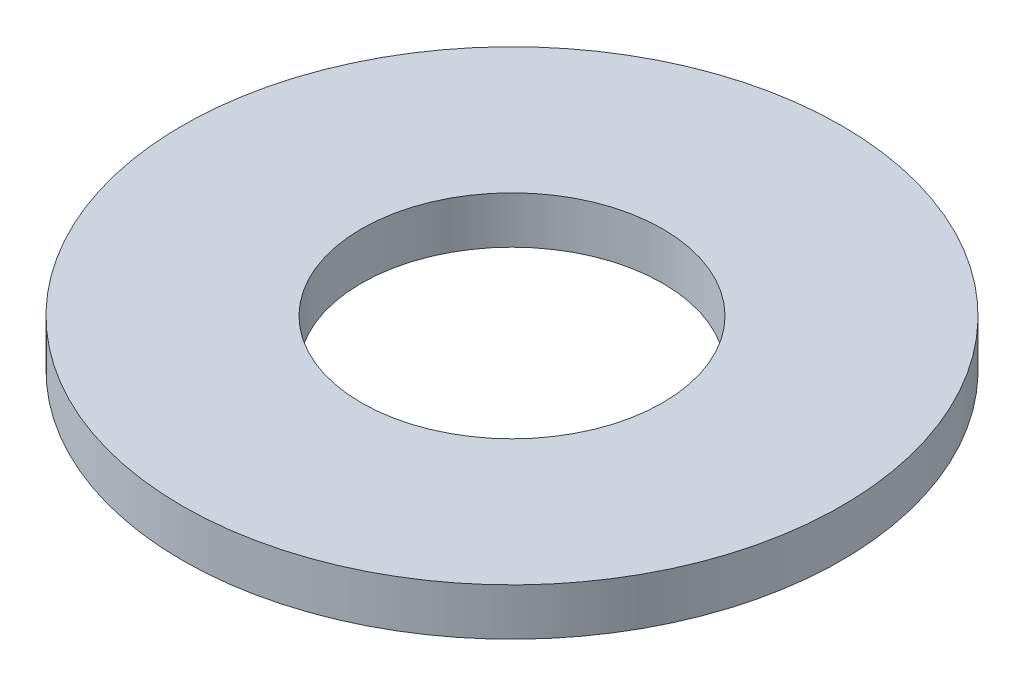
ISO-10303-21;
HEADER;
FILE_DESCRIPTION(('STEP AP214'),'2;1');
FILE_NAME('part.step','',(''),(''),'','','');
FILE_SCHEMA(('AUTOMOTIVE_DESIGN { 1 0 10303 214 1 1 1 1 }'));
ENDSEC;
DATA;
#1=APPLICATION_CONTEXT('core data for automotive mechanical design processes');
#2=APPLICATION_PROTOCOL_DEFINITION('international standard','automotive_design',2000,#1);
#3=PRODUCT_CONTEXT('',#1,'mechanical');
#4=PRODUCT('Part','Part','',(#3));
#5=PRODUCT_RELATED_PRODUCT_CATEGORY('part','',(#4));
#6=PRODUCT_DEFINITION_FORMATION('','',#4);
#7=PRODUCT_DEFINITION_CONTEXT('part definition',#1,'design');
#8=PRODUCT_DEFINITION('design','',#6,#7);
#9=PRODUCT_DEFINITION_SHAPE('','',#8);
#10=(LENGTH_UNIT() NAMED_UNIT(*) SI_UNIT(.MILLI.,.METRE.));
#11=(NAMED_UNIT(*) PLANE_ANGLE_UNIT() SI_UNIT($,.RADIAN.));
#12=(NAMED_UNIT(*) SI_UNIT($,.STERADIAN.) SOLID_ANGLE_UNIT());
#13=UNCERTAINTY_MEASURE_WITH_UNIT(LENGTH_MEASURE(1.E-05),#10,'distance_accuracy_value','');
#14=(GEOMETRIC_REPRESENTATION_CONTEXT(3) GLOBAL_UNCERTAINTY_ASSIGNED_CONTEXT((#13)) GLOBAL_UNIT_ASSIGNED_CONTEXT((#10,
#11,#12)) REPRESENTATION_CONTEXT('',''));
#15=CARTESIAN_POINT('',(0.,0.,0.));
#16=DIRECTION('',(0.,0.,1.));
#17=DIRECTION('',(1.,0.,0.));
#18=AXIS2_PLACEMENT_3D('',#15,#16,#17);
#19=CARTESIAN_POINT('',(0.,0.5,0.));
#20=DIRECTION('',(0.,1.,0.));
#21=DIRECTION('',(0.,0.,1.));
#22=AXIS2_PLACEMENT_3D('',#19,#20,#21);
#23=PLANE('',#22);
#24=CARTESIAN_POINT('',(0.,0.5,0.));
#25=DIRECTION('',(0.,1.,0.));
#26=DIRECTION('',(0.,0.,1.));
#27=AXIS2_PLACEMENT_3D('',#24,#25,#26);
#28=CIRCLE('',#27,3.5);
#29=CARTESIAN_POINT('',(0.,0.5,3.5));
#30=VERTEX_POINT('',#29);
#31=EDGE_CURVE('E10',#30,#30,#28,.T.);
#32=ORIENTED_EDGE('',*,*,#31,.T.);
#33=EDGE_LOOP('',(#32));
#34=FACE_BOUND('',#33,.T.);
#35=CARTESIAN_POINT('',(0.,0.5,0.));
#36=DIRECTION('',(0.,1.,0.));
#37=DIRECTION('',(0.,0.,1.));
#38=AXIS2_PLACEMENT_3D('',#35,#36,#37);
#39=CIRCLE('',#38,1.6);
#40=CARTESIAN_POINT('',(0.,0.5,1.6));
#41=VERTEX_POINT('',#40);
#42=EDGE_CURVE('E39',#41,#41,#39,.T.);
#43=ORIENTED_EDGE('',*,*,#42,.F.);
#44=EDGE_LOOP('',(#43));
#45=FACE_BOUND('',#44,.T.);
#46=ADVANCED_FACE('F28',(#34,#45),#23,.T.);
#47=CARTESIAN_POINT('',(0.,0.,0.));
#48=DIRECTION('',(0.,1.,0.));
#49=DIRECTION('',(0.,0.,1.));
#50=AXIS2_PLACEMENT_3D('',#47,#48,#49);
#51=PLANE('',#50);
#52=CARTESIAN_POINT('',(0.,0.,0.));
#53=DIRECTION('',(0.,1.,0.));
#54=DIRECTION('',(0.,0.,1.));
#55=AXIS2_PLACEMENT_3D('',#52,#53,#54);
#56=CIRCLE('',#55,3.5);
#57=CARTESIAN_POINT('',(0.,0.,3.5));
#58=VERTEX_POINT('',#57);
#59=EDGE_CURVE('E32',#58,#58,#56,.T.);
#60=ORIENTED_EDGE('',*,*,#59,.F.);
#61=EDGE_LOOP('',(#60));
#62=FACE_BOUND('',#61,.T.);
#63=CARTESIAN_POINT('',(0.,0.,0.));
#64=DIRECTION('',(0.,1.,0.));
#65=DIRECTION('',(0.,0.,1.));
#66=AXIS2_PLACEMENT_3D('',#63,#64,#65);
#67=CIRCLE('',#66,1.6);
#68=CARTESIAN_POINT('',(0.,0.,1.6));
#69=VERTEX_POINT('',#68);
#70=EDGE_CURVE('E41',#69,#69,#67,.T.);
#71=ORIENTED_EDGE('',*,*,#70,.T.);
#72=EDGE_LOOP('',(#71));
#73=FACE_BOUND('',#72,.T.);
#74=ADVANCED_FACE('F51',(#62,#73),#51,.F.);
#75=CARTESIAN_POINT('',(0.,0.5,0.));
#76=DIRECTION('',(0.,-1.,0.));
#77=DIRECTION('',(0.,0.,-1.));
#78=AXIS2_PLACEMENT_3D('',#75,#76,#77);
#79=CYLINDRICAL_SURFACE('',#78,3.5);
#80=ORIENTED_EDGE('',*,*,#31,.F.);
#81=EDGE_LOOP('',(#80));
#82=FACE_BOUND('',#81,.T.);
#83=ORIENTED_EDGE('',*,*,#59,.T.);
#84=EDGE_LOOP('',(#83));
#85=FACE_BOUND('',#84,.T.);
#86=ADVANCED_FACE('F30',(#82,#85),#79,.T.);
#87=CARTESIAN_POINT('',(0.,0.5,0.));
#88=DIRECTION('',(0.,-1.,0.));
#89=DIRECTION('',(0.,0.,-1.));
#90=AXIS2_PLACEMENT_3D('',#87,#88,#89);
#91=CYLINDRICAL_SURFACE('',#90,1.6);
#92=ORIENTED_EDGE('',*,*,#42,.T.);
#93=EDGE_LOOP('',(#92));
#94=FACE_BOUND('',#93,.T.);
#95=ORIENTED_EDGE('',*,*,#70,.F.);
#96=EDGE_LOOP('',(#95));
#97=FACE_BOUND('',#96,.T.);
#98=ADVANCED_FACE('F47',(#94,#97),#91,.F.);
#99=CLOSED_SHELL('',(#46,#74,#86,#98));
#100=MANIFOLD_SOLID_BREP('B2',#99);
#101=ADVANCED_BREP_SHAPE_REPRESENTATION('',(#18,#100),#14);
#102=SHAPE_DEFINITION_REPRESENTATION(#9,#101);
ENDSEC;
END-ISO-10303-21;
